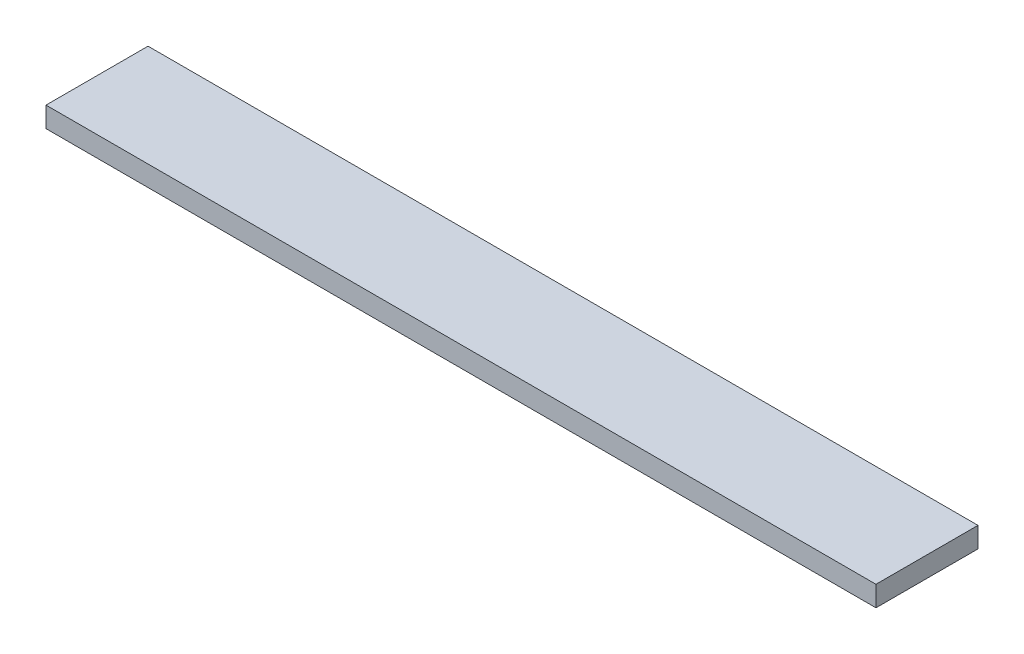
ISO-10303-21;
HEADER;
FILE_DESCRIPTION(('STEP AP214'),'2;1');
FILE_NAME('part.step','',(''),(''),'','','');
FILE_SCHEMA(('AUTOMOTIVE_DESIGN { 1 0 10303 214 1 1 1 1 }'));
ENDSEC;
DATA;
#1=APPLICATION_CONTEXT('core data for automotive mechanical design processes');
#2=APPLICATION_PROTOCOL_DEFINITION('international standard','automotive_design',2000,#1);
#3=PRODUCT_CONTEXT('',#1,'mechanical');
#4=PRODUCT('Part','Part','',(#3));
#5=PRODUCT_RELATED_PRODUCT_CATEGORY('part','',(#4));
#6=PRODUCT_DEFINITION_FORMATION('','',#4);
#7=PRODUCT_DEFINITION_CONTEXT('part definition',#1,'design');
#8=PRODUCT_DEFINITION('design','',#6,#7);
#9=PRODUCT_DEFINITION_SHAPE('','',#8);
#10=(LENGTH_UNIT() NAMED_UNIT(*) SI_UNIT(.MILLI.,.METRE.));
#11=(NAMED_UNIT(*) PLANE_ANGLE_UNIT() SI_UNIT($,.RADIAN.));
#12=(NAMED_UNIT(*) SI_UNIT($,.STERADIAN.) SOLID_ANGLE_UNIT());
#13=UNCERTAINTY_MEASURE_WITH_UNIT(LENGTH_MEASURE(1.E-05),#10,'distance_accuracy_value','');
#14=(GEOMETRIC_REPRESENTATION_CONTEXT(3) GLOBAL_UNCERTAINTY_ASSIGNED_CONTEXT((#13)) GLOBAL_UNIT_ASSIGNED_CONTEXT((#10,
#11,#12)) REPRESENTATION_CONTEXT('',''));
#15=CARTESIAN_POINT('',(0.,0.,0.));
#16=DIRECTION('',(0.,0.,1.));
#17=DIRECTION('',(1.,0.,0.));
#18=AXIS2_PLACEMENT_3D('',#15,#16,#17);
#19=CARTESIAN_POINT('',(0.,3.,0.));
#20=DIRECTION('',(1.,0.,0.));
#21=DIRECTION('',(0.,0.,-1.));
#22=AXIS2_PLACEMENT_3D('',#19,#20,#21);
#23=PLANE('',#22);
#24=DIRECTION('',(0.,0.,1.));
#25=VECTOR('',#24,1.);
#26=CARTESIAN_POINT('',(0.,0.,0.));
#27=LINE('',#26,#25);
#28=CARTESIAN_POINT('',(0.,0.,-15.));
#29=VERTEX_POINT('',#28);
#30=CARTESIAN_POINT('',(0.,0.,0.));
#31=VERTEX_POINT('',#30);
#32=EDGE_CURVE('E107',#29,#31,#27,.T.);
#33=ORIENTED_EDGE('',*,*,#32,.T.);
#34=DIRECTION('',(0.,-1.,0.));
#35=VECTOR('',#34,1.);
#36=CARTESIAN_POINT('',(0.,3.,0.));
#37=LINE('',#36,#35);
#38=CARTESIAN_POINT('',(0.,3.,0.));
#39=VERTEX_POINT('',#38);
#40=EDGE_CURVE('E11',#39,#31,#37,.T.);
#41=ORIENTED_EDGE('',*,*,#40,.F.);
#42=DIRECTION('',(0.,0.,1.));
#43=VECTOR('',#42,1.);
#44=CARTESIAN_POINT('',(0.,3.,0.));
#45=LINE('',#44,#43);
#46=CARTESIAN_POINT('',(0.,3.,-15.));
#47=VERTEX_POINT('',#46);
#48=EDGE_CURVE('E91',#47,#39,#45,.T.);
#49=ORIENTED_EDGE('',*,*,#48,.F.);
#50=DIRECTION('',(0.,-1.,0.));
#51=VECTOR('',#50,1.);
#52=CARTESIAN_POINT('',(0.,3.,-15.));
#53=LINE('',#52,#51);
#54=EDGE_CURVE('E103',#47,#29,#53,.T.);
#55=ORIENTED_EDGE('',*,*,#54,.T.);
#56=EDGE_LOOP('',(#33,#41,#49,#55));
#57=FACE_BOUND('',#56,.T.);
#58=ADVANCED_FACE('F39',(#57),#23,.F.);
#59=CARTESIAN_POINT('',(0.,3.,0.));
#60=DIRECTION('',(0.,0.,-1.));
#61=DIRECTION('',(-1.,0.,0.));
#62=AXIS2_PLACEMENT_3D('',#59,#60,#61);
#63=PLANE('',#62);
#64=DIRECTION('',(1.,0.,0.));
#65=VECTOR('',#64,1.);
#66=CARTESIAN_POINT('',(0.,0.,0.));
#67=LINE('',#66,#65);
#68=CARTESIAN_POINT('',(122.,0.,0.));
#69=VERTEX_POINT('',#68);
#70=EDGE_CURVE('E96',#31,#69,#67,.T.);
#71=ORIENTED_EDGE('',*,*,#70,.T.);
#72=DIRECTION('',(0.,-1.,0.));
#73=VECTOR('',#72,1.);
#74=CARTESIAN_POINT('',(122.,3.,0.));
#75=LINE('',#74,#73);
#76=CARTESIAN_POINT('',(122.,3.,0.));
#77=VERTEX_POINT('',#76);
#78=EDGE_CURVE('E48',#77,#69,#75,.T.);
#79=ORIENTED_EDGE('',*,*,#78,.F.);
#80=DIRECTION('',(1.,0.,0.));
#81=VECTOR('',#80,1.);
#82=CARTESIAN_POINT('',(0.,3.,0.));
#83=LINE('',#82,#81);
#84=EDGE_CURVE('E86',#39,#77,#83,.T.);
#85=ORIENTED_EDGE('',*,*,#84,.F.);
#86=ORIENTED_EDGE('',*,*,#40,.T.);
#87=EDGE_LOOP('',(#71,#79,#85,#86));
#88=FACE_BOUND('',#87,.T.);
#89=ADVANCED_FACE('F95',(#88),#63,.F.);
#90=CARTESIAN_POINT('',(122.,3.,0.));
#91=DIRECTION('',(-1.,0.,0.));
#92=DIRECTION('',(0.,0.,1.));
#93=AXIS2_PLACEMENT_3D('',#90,#91,#92);
#94=PLANE('',#93);
#95=DIRECTION('',(0.,0.,-1.));
#96=VECTOR('',#95,1.);
#97=CARTESIAN_POINT('',(122.,0.,0.));
#98=LINE('',#97,#96);
#99=CARTESIAN_POINT('',(122.,0.,-15.));
#100=VERTEX_POINT('',#99);
#101=EDGE_CURVE('E73',#69,#100,#98,.T.);
#102=ORIENTED_EDGE('',*,*,#101,.T.);
#103=DIRECTION('',(0.,-1.,0.));
#104=VECTOR('',#103,1.);
#105=CARTESIAN_POINT('',(122.,3.,-15.));
#106=LINE('',#105,#104);
#107=CARTESIAN_POINT('',(122.,3.,-15.));
#108=VERTEX_POINT('',#107);
#109=EDGE_CURVE('E98',#108,#100,#106,.T.);
#110=ORIENTED_EDGE('',*,*,#109,.F.);
#111=DIRECTION('',(0.,0.,-1.));
#112=VECTOR('',#111,1.);
#113=CARTESIAN_POINT('',(122.,3.,0.));
#114=LINE('',#113,#112);
#115=EDGE_CURVE('E89',#77,#108,#114,.T.);
#116=ORIENTED_EDGE('',*,*,#115,.F.);
#117=ORIENTED_EDGE('',*,*,#78,.T.);
#118=EDGE_LOOP('',(#102,#110,#116,#117));
#119=FACE_BOUND('',#118,.T.);
#120=ADVANCED_FACE('F99',(#119),#94,.F.);
#121=CARTESIAN_POINT('',(0.,3.,-15.));
#122=DIRECTION('',(0.,0.,1.));
#123=DIRECTION('',(1.,0.,0.));
#124=AXIS2_PLACEMENT_3D('',#121,#122,#123);
#125=PLANE('',#124);
#126=DIRECTION('',(-1.,0.,0.));
#127=VECTOR('',#126,1.);
#128=CARTESIAN_POINT('',(0.,0.,-15.));
#129=LINE('',#128,#127);
#130=EDGE_CURVE('E79',#100,#29,#129,.T.);
#131=ORIENTED_EDGE('',*,*,#130,.T.);
#132=ORIENTED_EDGE('',*,*,#54,.F.);
#133=DIRECTION('',(-1.,0.,0.));
#134=VECTOR('',#133,1.);
#135=CARTESIAN_POINT('',(0.,3.,-15.));
#136=LINE('',#135,#134);
#137=EDGE_CURVE('E56',#108,#47,#136,.T.);
#138=ORIENTED_EDGE('',*,*,#137,.F.);
#139=ORIENTED_EDGE('',*,*,#109,.T.);
#140=EDGE_LOOP('',(#131,#132,#138,#139));
#141=FACE_BOUND('',#140,.T.);
#142=ADVANCED_FACE('F120',(#141),#125,.F.);
#143=CARTESIAN_POINT('',(0.,3.,0.));
#144=DIRECTION('',(0.,-1.,0.));
#145=DIRECTION('',(0.,0.,-1.));
#146=AXIS2_PLACEMENT_3D('',#143,#144,#145);
#147=PLANE('',#146);
#148=ORIENTED_EDGE('',*,*,#48,.T.);
#149=ORIENTED_EDGE('',*,*,#84,.T.);
#150=ORIENTED_EDGE('',*,*,#115,.T.);
#151=ORIENTED_EDGE('',*,*,#137,.T.);
#152=EDGE_LOOP('',(#148,#149,#150,#151));
#153=FACE_BOUND('',#152,.T.);
#154=ADVANCED_FACE('F87',(#153),#147,.F.);
#155=CARTESIAN_POINT('',(0.,0.,0.));
#156=DIRECTION('',(0.,-1.,0.));
#157=DIRECTION('',(0.,0.,-1.));
#158=AXIS2_PLACEMENT_3D('',#155,#156,#157);
#159=PLANE('',#158);
#160=ORIENTED_EDGE('',*,*,#32,.F.);
#161=ORIENTED_EDGE('',*,*,#130,.F.);
#162=ORIENTED_EDGE('',*,*,#101,.F.);
#163=ORIENTED_EDGE('',*,*,#70,.F.);
#164=EDGE_LOOP('',(#160,#161,#162,#163));
#165=FACE_BOUND('',#164,.T.);
#166=ADVANCED_FACE('F123',(#165),#159,.T.);
#167=CLOSED_SHELL('',(#58,#89,#120,#142,#154,#166));
#168=MANIFOLD_SOLID_BREP('B2',#167);
#169=ADVANCED_BREP_SHAPE_REPRESENTATION('',(#18,#168),#14);
#170=SHAPE_DEFINITION_REPRESENTATION(#9,#169);
ENDSEC;
END-ISO-10303-21;
